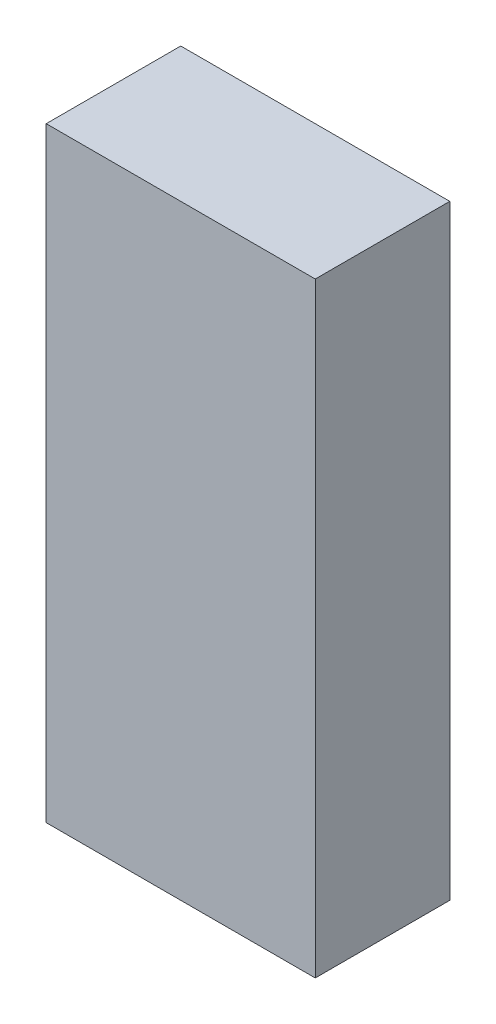
ISO-10303-21;
HEADER;
FILE_DESCRIPTION(('STEP AP214'),'2;1');
FILE_NAME('part.step','',(''),(''),'','','');
FILE_SCHEMA(('AUTOMOTIVE_DESIGN { 1 0 10303 214 1 1 1 1 }'));
ENDSEC;
DATA;
#1=APPLICATION_CONTEXT('core data for automotive mechanical design processes');
#2=APPLICATION_PROTOCOL_DEFINITION('international standard','automotive_design',2000,#1);
#3=PRODUCT_CONTEXT('',#1,'mechanical');
#4=PRODUCT('Part','Part','',(#3));
#5=PRODUCT_RELATED_PRODUCT_CATEGORY('part','',(#4));
#6=PRODUCT_DEFINITION_FORMATION('','',#4);
#7=PRODUCT_DEFINITION_CONTEXT('part definition',#1,'design');
#8=PRODUCT_DEFINITION('design','',#6,#7);
#9=PRODUCT_DEFINITION_SHAPE('','',#8);
#10=(LENGTH_UNIT() NAMED_UNIT(*) SI_UNIT(.MILLI.,.METRE.));
#11=(NAMED_UNIT(*) PLANE_ANGLE_UNIT() SI_UNIT($,.RADIAN.));
#12=(NAMED_UNIT(*) SI_UNIT($,.STERADIAN.) SOLID_ANGLE_UNIT());
#13=UNCERTAINTY_MEASURE_WITH_UNIT(LENGTH_MEASURE(1.E-05),#10,'distance_accuracy_value','');
#14=(GEOMETRIC_REPRESENTATION_CONTEXT(3) GLOBAL_UNCERTAINTY_ASSIGNED_CONTEXT((#13)) GLOBAL_UNIT_ASSIGNED_CONTEXT((#10,
#11,#12)) REPRESENTATION_CONTEXT('',''));
#15=CARTESIAN_POINT('',(0.,0.,0.));
#16=DIRECTION('',(0.,0.,1.));
#17=DIRECTION('',(1.,0.,0.));
#18=AXIS2_PLACEMENT_3D('',#15,#16,#17);
#19=CARTESIAN_POINT('',(0.4,2.525,0.));
#20=DIRECTION('',(1.,0.,0.));
#21=DIRECTION('',(0.,0.,1.));
#22=AXIS2_PLACEMENT_3D('',#19,#20,#21);
#23=PLANE('',#22);
#24=DIRECTION('',(0.,1.,0.));
#25=VECTOR('',#24,1.);
#26=CARTESIAN_POINT('',(0.4,2.525,0.1));
#27=LINE('',#26,#25);
#28=CARTESIAN_POINT('',(0.4,2.525,0.1));
#29=VERTEX_POINT('',#28);
#30=CARTESIAN_POINT('',(0.4,2.975,0.1));
#31=VERTEX_POINT('',#30);
#32=EDGE_CURVE('E11',#29,#31,#27,.T.);
#33=ORIENTED_EDGE('',*,*,#32,.T.);
#34=DIRECTION('',(0.,0.,1.));
#35=VECTOR('',#34,1.);
#36=CARTESIAN_POINT('',(0.4,2.975,0.));
#37=LINE('',#36,#35);
#38=CARTESIAN_POINT('',(0.4,2.975,0.));
#39=VERTEX_POINT('',#38);
#40=EDGE_CURVE('E24',#39,#31,#37,.T.);
#41=ORIENTED_EDGE('',*,*,#40,.F.);
#42=DIRECTION('',(0.,1.,0.));
#43=VECTOR('',#42,1.);
#44=CARTESIAN_POINT('',(0.4,2.525,0.));
#45=LINE('',#44,#43);
#46=CARTESIAN_POINT('',(0.4,2.525,0.));
#47=VERTEX_POINT('',#46);
#48=EDGE_CURVE('E86',#47,#39,#45,.T.);
#49=ORIENTED_EDGE('',*,*,#48,.F.);
#50=DIRECTION('',(0.,0.,1.));
#51=VECTOR('',#50,1.);
#52=CARTESIAN_POINT('',(0.4,2.525,0.));
#53=LINE('',#52,#51);
#54=EDGE_CURVE('E36',#47,#29,#53,.T.);
#55=ORIENTED_EDGE('',*,*,#54,.T.);
#56=EDGE_LOOP('',(#33,#41,#49,#55));
#57=FACE_BOUND('',#56,.T.);
#58=ADVANCED_FACE('F17',(#57),#23,.F.);
#59=CARTESIAN_POINT('',(0.6,2.525,0.));
#60=DIRECTION('',(1.,0.,0.));
#61=DIRECTION('',(0.,0.,1.));
#62=AXIS2_PLACEMENT_3D('',#59,#60,#61);
#63=PLANE('',#62);
#64=DIRECTION('',(0.,0.,1.));
#65=VECTOR('',#64,1.);
#66=CARTESIAN_POINT('',(0.6,2.525,0.));
#67=LINE('',#66,#65);
#68=CARTESIAN_POINT('',(0.6,2.525,0.));
#69=VERTEX_POINT('',#68);
#70=CARTESIAN_POINT('',(0.6,2.525,0.1));
#71=VERTEX_POINT('',#70);
#72=EDGE_CURVE('E83',#69,#71,#67,.T.);
#73=ORIENTED_EDGE('',*,*,#72,.F.);
#74=DIRECTION('',(0.,1.,0.));
#75=VECTOR('',#74,1.);
#76=CARTESIAN_POINT('',(0.6,2.525,0.));
#77=LINE('',#76,#75);
#78=CARTESIAN_POINT('',(0.6,2.975,0.));
#79=VERTEX_POINT('',#78);
#80=EDGE_CURVE('E63',#69,#79,#77,.T.);
#81=ORIENTED_EDGE('',*,*,#80,.T.);
#82=DIRECTION('',(0.,0.,1.));
#83=VECTOR('',#82,1.);
#84=CARTESIAN_POINT('',(0.6,2.975,0.));
#85=LINE('',#84,#83);
#86=CARTESIAN_POINT('',(0.6,2.975,0.1));
#87=VERTEX_POINT('',#86);
#88=EDGE_CURVE('E57',#79,#87,#85,.T.);
#89=ORIENTED_EDGE('',*,*,#88,.T.);
#90=DIRECTION('',(0.,1.,0.));
#91=VECTOR('',#90,1.);
#92=CARTESIAN_POINT('',(0.6,2.525,0.1));
#93=LINE('',#92,#91);
#94=EDGE_CURVE('E60',#71,#87,#93,.T.);
#95=ORIENTED_EDGE('',*,*,#94,.F.);
#96=EDGE_LOOP('',(#73,#81,#89,#95));
#97=FACE_BOUND('',#96,.T.);
#98=ADVANCED_FACE('F59',(#97),#63,.T.);
#99=CARTESIAN_POINT('',(0.4,2.525,0.));
#100=DIRECTION('',(0.,1.,0.));
#101=DIRECTION('',(0.,0.,1.));
#102=AXIS2_PLACEMENT_3D('',#99,#100,#101);
#103=PLANE('',#102);
#104=ORIENTED_EDGE('',*,*,#72,.T.);
#105=DIRECTION('',(1.,0.,0.));
#106=VECTOR('',#105,1.);
#107=CARTESIAN_POINT('',(0.4,2.525,0.1));
#108=LINE('',#107,#106);
#109=EDGE_CURVE('E71',#29,#71,#108,.T.);
#110=ORIENTED_EDGE('',*,*,#109,.F.);
#111=ORIENTED_EDGE('',*,*,#54,.F.);
#112=DIRECTION('',(1.,0.,0.));
#113=VECTOR('',#112,1.);
#114=CARTESIAN_POINT('',(0.4,2.525,0.));
#115=LINE('',#114,#113);
#116=EDGE_CURVE('E76',#47,#69,#115,.T.);
#117=ORIENTED_EDGE('',*,*,#116,.T.);
#118=EDGE_LOOP('',(#104,#110,#111,#117));
#119=FACE_BOUND('',#118,.T.);
#120=ADVANCED_FACE('F91',(#119),#103,.F.);
#121=CARTESIAN_POINT('',(0.4,2.975,0.));
#122=DIRECTION('',(0.,1.,0.));
#123=DIRECTION('',(0.,0.,1.));
#124=AXIS2_PLACEMENT_3D('',#121,#122,#123);
#125=PLANE('',#124);
#126=DIRECTION('',(1.,0.,0.));
#127=VECTOR('',#126,1.);
#128=CARTESIAN_POINT('',(0.4,2.975,0.));
#129=LINE('',#128,#127);
#130=EDGE_CURVE('E74',#39,#79,#129,.T.);
#131=ORIENTED_EDGE('',*,*,#130,.F.);
#132=ORIENTED_EDGE('',*,*,#40,.T.);
#133=DIRECTION('',(1.,0.,0.));
#134=VECTOR('',#133,1.);
#135=CARTESIAN_POINT('',(0.4,2.975,0.1));
#136=LINE('',#135,#134);
#137=EDGE_CURVE('E69',#31,#87,#136,.T.);
#138=ORIENTED_EDGE('',*,*,#137,.T.);
#139=ORIENTED_EDGE('',*,*,#88,.F.);
#140=EDGE_LOOP('',(#131,#132,#138,#139));
#141=FACE_BOUND('',#140,.T.);
#142=ADVANCED_FACE('F73',(#141),#125,.T.);
#143=CARTESIAN_POINT('',(0.4,2.525,0.));
#144=DIRECTION('',(0.,0.,1.));
#145=DIRECTION('',(1.,0.,0.));
#146=AXIS2_PLACEMENT_3D('',#143,#144,#145);
#147=PLANE('',#146);
#148=ORIENTED_EDGE('',*,*,#130,.T.);
#149=ORIENTED_EDGE('',*,*,#80,.F.);
#150=ORIENTED_EDGE('',*,*,#116,.F.);
#151=ORIENTED_EDGE('',*,*,#48,.T.);
#152=EDGE_LOOP('',(#148,#149,#150,#151));
#153=FACE_BOUND('',#152,.T.);
#154=ADVANCED_FACE('F89',(#153),#147,.F.);
#155=CARTESIAN_POINT('',(0.4,2.525,0.1));
#156=DIRECTION('',(0.,0.,1.));
#157=DIRECTION('',(1.,0.,0.));
#158=AXIS2_PLACEMENT_3D('',#155,#156,#157);
#159=PLANE('',#158);
#160=ORIENTED_EDGE('',*,*,#32,.F.);
#161=ORIENTED_EDGE('',*,*,#109,.T.);
#162=ORIENTED_EDGE('',*,*,#94,.T.);
#163=ORIENTED_EDGE('',*,*,#137,.F.);
#164=EDGE_LOOP('',(#160,#161,#162,#163));
#165=FACE_BOUND('',#164,.T.);
#166=ADVANCED_FACE('F68',(#165),#159,.T.);
#167=CLOSED_SHELL('',(#58,#98,#120,#142,#154,#166));
#168=MANIFOLD_SOLID_BREP('B1',#167);
#169=ADVANCED_BREP_SHAPE_REPRESENTATION('',(#18,#168),#14);
#170=SHAPE_DEFINITION_REPRESENTATION(#9,#169);
ENDSEC;
END-ISO-10303-21;
